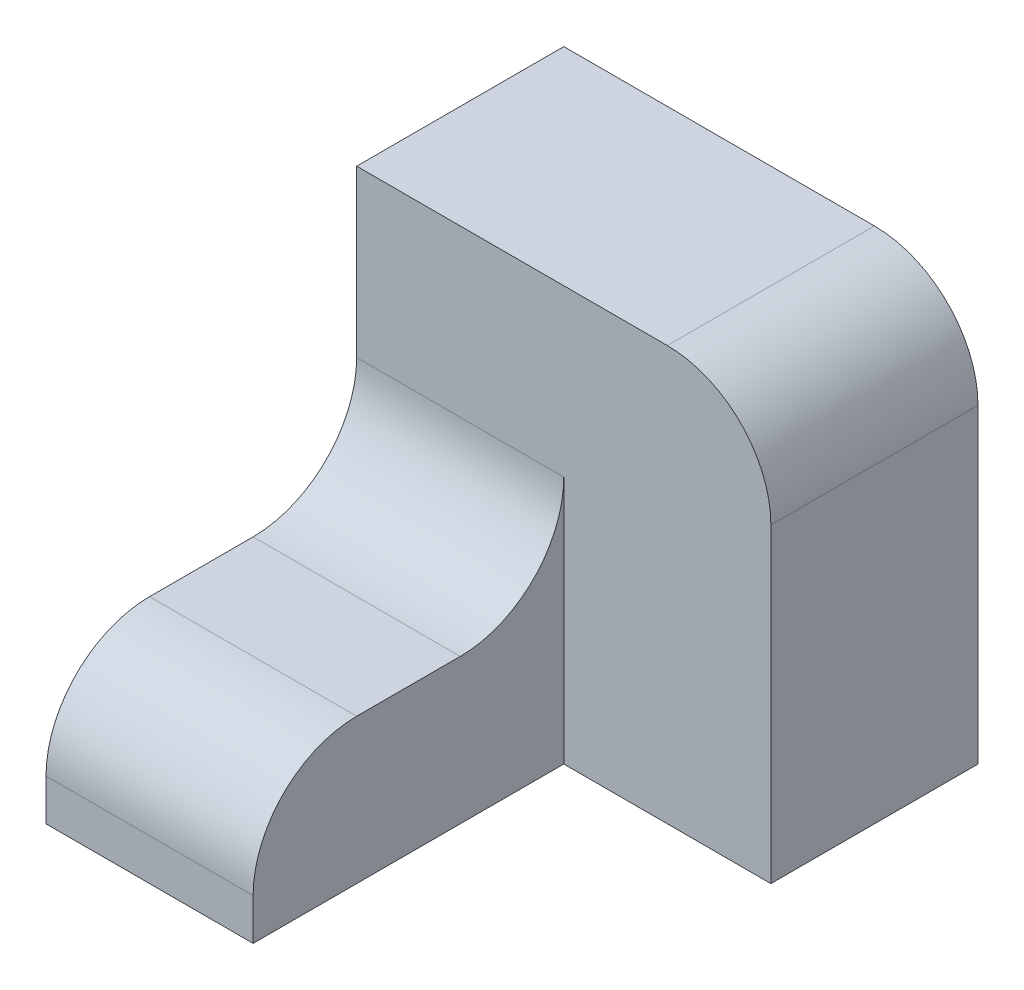
ISO-10303-21;
HEADER;
FILE_DESCRIPTION(('STEP AP214'),'2;1');
FILE_NAME('part.step','',(''),(''),'','','');
FILE_SCHEMA(('AUTOMOTIVE_DESIGN { 1 0 10303 214 1 1 1 1 }'));
ENDSEC;
DATA;
#1=APPLICATION_CONTEXT('core data for automotive mechanical design processes');
#2=APPLICATION_PROTOCOL_DEFINITION('international standard','automotive_design',2000,#1);
#3=PRODUCT_CONTEXT('',#1,'mechanical');
#4=PRODUCT('Part','Part','',(#3));
#5=PRODUCT_RELATED_PRODUCT_CATEGORY('part','',(#4));
#6=PRODUCT_DEFINITION_FORMATION('','',#4);
#7=PRODUCT_DEFINITION_CONTEXT('part definition',#1,'design');
#8=PRODUCT_DEFINITION('design','',#6,#7);
#9=PRODUCT_DEFINITION_SHAPE('','',#8);
#10=(LENGTH_UNIT() NAMED_UNIT(*) SI_UNIT(.MILLI.,.METRE.));
#11=(NAMED_UNIT(*) PLANE_ANGLE_UNIT() SI_UNIT($,.RADIAN.));
#12=(NAMED_UNIT(*) SI_UNIT($,.STERADIAN.) SOLID_ANGLE_UNIT());
#13=UNCERTAINTY_MEASURE_WITH_UNIT(LENGTH_MEASURE(1.E-05),#10,'distance_accuracy_value','');
#14=(GEOMETRIC_REPRESENTATION_CONTEXT(3) GLOBAL_UNCERTAINTY_ASSIGNED_CONTEXT((#13)) GLOBAL_UNIT_ASSIGNED_CONTEXT((#10,
#11,#12)) REPRESENTATION_CONTEXT('',''));
#15=CARTESIAN_POINT('',(0.,0.,0.));
#16=DIRECTION('',(0.,0.,1.));
#17=DIRECTION('',(1.,0.,0.));
#18=AXIS2_PLACEMENT_3D('',#15,#16,#17);
#19=CARTESIAN_POINT('',(-10.,0.,30.));
#20=DIRECTION('',(0.,-1.,0.));
#21=DIRECTION('',(1.,0.,0.));
#22=AXIS2_PLACEMENT_3D('',#19,#20,#21);
#23=PLANE('',#22);
#24=DIRECTION('',(0.,0.,-1.));
#25=VECTOR('',#24,1.);
#26=CARTESIAN_POINT('',(-10.,0.,30.));
#27=LINE('',#26,#25);
#28=CARTESIAN_POINT('',(-10.,0.,20.));
#29=VERTEX_POINT('',#28);
#30=CARTESIAN_POINT('',(-10.,0.,10.));
#31=VERTEX_POINT('',#30);
#32=EDGE_CURVE('E164',#29,#31,#27,.T.);
#33=ORIENTED_EDGE('',*,*,#32,.T.);
#34=DIRECTION('',(-1.,0.,0.));
#35=VECTOR('',#34,1.);
#36=CARTESIAN_POINT('',(-10.,0.,10.));
#37=LINE('',#36,#35);
#38=CARTESIAN_POINT('',(-30.,0.,10.));
#39=VERTEX_POINT('',#38);
#40=EDGE_CURVE('E178',#31,#39,#37,.T.);
#41=ORIENTED_EDGE('',*,*,#40,.T.);
#42=DIRECTION('',(0.,0.,-1.));
#43=VECTOR('',#42,1.);
#44=CARTESIAN_POINT('',(-30.,0.,30.));
#45=LINE('',#44,#43);
#46=CARTESIAN_POINT('',(-30.,0.,20.));
#47=VERTEX_POINT('',#46);
#48=EDGE_CURVE('E173',#47,#39,#45,.T.);
#49=ORIENTED_EDGE('',*,*,#48,.F.);
#50=DIRECTION('',(-1.,0.,0.));
#51=VECTOR('',#50,1.);
#52=CARTESIAN_POINT('',(-10.,0.,20.));
#53=LINE('',#52,#51);
#54=EDGE_CURVE('E176',#47,#29,#53,.F.);
#55=ORIENTED_EDGE('',*,*,#54,.T.);
#56=EDGE_LOOP('',(#33,#41,#49,#55));
#57=FACE_BOUND('',#56,.T.);
#58=ADVANCED_FACE('F35',(#57),#23,.F.);
#59=CARTESIAN_POINT('',(-30.,0.,30.));
#60=DIRECTION('',(1.,0.,0.));
#61=DIRECTION('',(0.,0.,-1.));
#62=AXIS2_PLACEMENT_3D('',#59,#60,#61);
#63=PLANE('',#62);
#64=DIRECTION('',(0.,-1.,0.));
#65=VECTOR('',#64,1.);
#66=CARTESIAN_POINT('',(-30.,0.,30.));
#67=LINE('',#66,#65);
#68=CARTESIAN_POINT('',(-30.,-10.,30.));
#69=VERTEX_POINT('',#68);
#70=CARTESIAN_POINT('',(-30.,-14.,30.));
#71=VERTEX_POINT('',#70);
#72=EDGE_CURVE('E158',#69,#71,#67,.T.);
#73=ORIENTED_EDGE('',*,*,#72,.F.);
#74=CARTESIAN_POINT('',(-30.,-10.,20.));
#75=DIRECTION('',(1.,0.,0.));
#76=DIRECTION('',(0.,0.,-1.));
#77=AXIS2_PLACEMENT_3D('',#74,#75,#76);
#78=CIRCLE('',#77,10.);
#79=EDGE_CURVE('E58',#69,#47,#78,.F.);
#80=ORIENTED_EDGE('',*,*,#79,.T.);
#81=ORIENTED_EDGE('',*,*,#48,.T.);
#82=CARTESIAN_POINT('',(-30.,10.,10.));
#83=DIRECTION('',(1.,0.,0.));
#84=DIRECTION('',(0.,0.,-1.));
#85=AXIS2_PLACEMENT_3D('',#82,#83,#84);
#86=CIRCLE('',#85,10.);
#87=CARTESIAN_POINT('',(-30.,10.,0.));
#88=VERTEX_POINT('',#87);
#89=EDGE_CURVE('E43',#39,#88,#86,.T.);
#90=ORIENTED_EDGE('',*,*,#89,.T.);
#91=DIRECTION('',(0.,-1.,0.));
#92=VECTOR('',#91,1.);
#93=CARTESIAN_POINT('',(-30.,26.,0.));
#94=LINE('',#93,#92);
#95=CARTESIAN_POINT('',(-30.,26.,0.));
#96=VERTEX_POINT('',#95);
#97=EDGE_CURVE('E134',#96,#88,#94,.T.);
#98=ORIENTED_EDGE('',*,*,#97,.F.);
#99=DIRECTION('',(0.,0.,1.));
#100=VECTOR('',#99,1.);
#101=CARTESIAN_POINT('',(-30.,26.,-20.));
#102=LINE('',#101,#100);
#103=CARTESIAN_POINT('',(-30.,26.,-20.));
#104=VERTEX_POINT('',#103);
#105=EDGE_CURVE('E118',#104,#96,#102,.T.);
#106=ORIENTED_EDGE('',*,*,#105,.F.);
#107=DIRECTION('',(0.,-1.,0.));
#108=VECTOR('',#107,1.);
#109=CARTESIAN_POINT('',(-30.,26.,-20.));
#110=LINE('',#109,#108);
#111=CARTESIAN_POINT('',(-30.,-14.,-20.));
#112=VERTEX_POINT('',#111);
#113=EDGE_CURVE('E125',#104,#112,#110,.T.);
#114=ORIENTED_EDGE('',*,*,#113,.T.);
#115=DIRECTION('',(0.,0.,-1.));
#116=VECTOR('',#115,1.);
#117=CARTESIAN_POINT('',(-30.,-14.,30.));
#118=LINE('',#117,#116);
#119=EDGE_CURVE('E171',#71,#112,#118,.T.);
#120=ORIENTED_EDGE('',*,*,#119,.F.);
#121=EDGE_LOOP('',(#73,#80,#81,#90,#98,#106,#114,#120));
#122=FACE_BOUND('',#121,.T.);
#123=ADVANCED_FACE('F131',(#122),#63,.F.);
#124=CARTESIAN_POINT('',(-30.,-14.,30.));
#125=DIRECTION('',(0.,1.,0.));
#126=DIRECTION('',(0.,0.,1.));
#127=AXIS2_PLACEMENT_3D('',#124,#125,#126);
#128=PLANE('',#127);
#129=ORIENTED_EDGE('',*,*,#119,.T.);
#130=DIRECTION('',(1.,0.,0.));
#131=VECTOR('',#130,1.);
#132=CARTESIAN_POINT('',(-30.,-14.,-20.));
#133=LINE('',#132,#131);
#134=CARTESIAN_POINT('',(10.,-14.,-20.));
#135=VERTEX_POINT('',#134);
#136=EDGE_CURVE('E142',#112,#135,#133,.T.);
#137=ORIENTED_EDGE('',*,*,#136,.T.);
#138=DIRECTION('',(0.,0.,1.));
#139=VECTOR('',#138,1.);
#140=CARTESIAN_POINT('',(10.,-14.,-20.));
#141=LINE('',#140,#139);
#142=CARTESIAN_POINT('',(10.,-14.,0.));
#143=VERTEX_POINT('',#142);
#144=EDGE_CURVE('E135',#135,#143,#141,.T.);
#145=ORIENTED_EDGE('',*,*,#144,.T.);
#146=DIRECTION('',(1.,0.,0.));
#147=VECTOR('',#146,1.);
#148=CARTESIAN_POINT('',(-30.,-14.,0.));
#149=LINE('',#148,#147);
#150=CARTESIAN_POINT('',(-10.,-14.,0.));
#151=VERTEX_POINT('',#150);
#152=EDGE_CURVE('E151',#151,#143,#149,.T.);
#153=ORIENTED_EDGE('',*,*,#152,.F.);
#154=DIRECTION('',(0.,0.,-1.));
#155=VECTOR('',#154,1.);
#156=CARTESIAN_POINT('',(-10.,-14.,30.));
#157=LINE('',#156,#155);
#158=CARTESIAN_POINT('',(-10.,-14.,30.));
#159=VERTEX_POINT('',#158);
#160=EDGE_CURVE('E168',#159,#151,#157,.T.);
#161=ORIENTED_EDGE('',*,*,#160,.F.);
#162=DIRECTION('',(1.,0.,0.));
#163=VECTOR('',#162,1.);
#164=CARTESIAN_POINT('',(-30.,-14.,30.));
#165=LINE('',#164,#163);
#166=EDGE_CURVE('E160',#71,#159,#165,.T.);
#167=ORIENTED_EDGE('',*,*,#166,.F.);
#168=EDGE_LOOP('',(#129,#137,#145,#153,#161,#167));
#169=FACE_BOUND('',#168,.T.);
#170=ADVANCED_FACE('F210',(#169),#128,.F.);
#171=CARTESIAN_POINT('',(-10.,-14.,30.));
#172=DIRECTION('',(-1.,0.,0.));
#173=DIRECTION('',(0.,0.,1.));
#174=AXIS2_PLACEMENT_3D('',#171,#172,#173);
#175=PLANE('',#174);
#176=ORIENTED_EDGE('',*,*,#32,.F.);
#177=CARTESIAN_POINT('',(-10.,-10.,20.));
#178=DIRECTION('',(-1.,0.,0.));
#179=DIRECTION('',(0.,0.,1.));
#180=AXIS2_PLACEMENT_3D('',#177,#178,#179);
#181=CIRCLE('',#180,10.);
#182=CARTESIAN_POINT('',(-10.,-10.,30.));
#183=VERTEX_POINT('',#182);
#184=EDGE_CURVE('E50',#29,#183,#181,.F.);
#185=ORIENTED_EDGE('',*,*,#184,.T.);
#186=DIRECTION('',(0.,1.,0.));
#187=VECTOR('',#186,1.);
#188=CARTESIAN_POINT('',(-10.,-14.,30.));
#189=LINE('',#188,#187);
#190=EDGE_CURVE('E162',#159,#183,#189,.T.);
#191=ORIENTED_EDGE('',*,*,#190,.F.);
#192=ORIENTED_EDGE('',*,*,#160,.T.);
#193=DIRECTION('',(0.,1.,0.));
#194=VECTOR('',#193,1.);
#195=CARTESIAN_POINT('',(-10.,-14.,0.));
#196=LINE('',#195,#194);
#197=CARTESIAN_POINT('',(-10.,10.,0.));
#198=VERTEX_POINT('',#197);
#199=EDGE_CURVE('E156',#151,#198,#196,.T.);
#200=ORIENTED_EDGE('',*,*,#199,.T.);
#201=CARTESIAN_POINT('',(-10.,10.,10.));
#202=DIRECTION('',(-1.,0.,0.));
#203=DIRECTION('',(0.,0.,1.));
#204=AXIS2_PLACEMENT_3D('',#201,#202,#203);
#205=CIRCLE('',#204,10.);
#206=EDGE_CURVE('E11',#198,#31,#205,.T.);
#207=ORIENTED_EDGE('',*,*,#206,.T.);
#208=EDGE_LOOP('',(#176,#185,#191,#192,#200,#207));
#209=FACE_BOUND('',#208,.T.);
#210=ADVANCED_FACE('F203',(#209),#175,.F.);
#211=CARTESIAN_POINT('',(0.,0.,30.));
#212=DIRECTION('',(0.,0.,1.));
#213=DIRECTION('',(1.,0.,0.));
#214=AXIS2_PLACEMENT_3D('',#211,#212,#213);
#215=PLANE('',#214);
#216=ORIENTED_EDGE('',*,*,#190,.T.);
#217=DIRECTION('',(-1.,0.,0.));
#218=VECTOR('',#217,1.);
#219=CARTESIAN_POINT('',(-30.,-10.,30.));
#220=LINE('',#219,#218);
#221=EDGE_CURVE('E192',#183,#69,#220,.T.);
#222=ORIENTED_EDGE('',*,*,#221,.T.);
#223=ORIENTED_EDGE('',*,*,#72,.T.);
#224=ORIENTED_EDGE('',*,*,#166,.T.);
#225=EDGE_LOOP('',(#216,#222,#223,#224));
#226=FACE_BOUND('',#225,.T.);
#227=ADVANCED_FACE('F206',(#226),#215,.T.);
#228=CARTESIAN_POINT('',(0.,0.,0.));
#229=DIRECTION('',(0.,0.,1.));
#230=DIRECTION('',(1.,0.,0.));
#231=AXIS2_PLACEMENT_3D('',#228,#229,#230);
#232=PLANE('',#231);
#233=ORIENTED_EDGE('',*,*,#97,.T.);
#234=DIRECTION('',(-1.,0.,0.));
#235=VECTOR('',#234,1.);
#236=CARTESIAN_POINT('',(0.,10.,0.));
#237=LINE('',#236,#235);
#238=EDGE_CURVE('E183',#88,#198,#237,.F.);
#239=ORIENTED_EDGE('',*,*,#238,.T.);
#240=ORIENTED_EDGE('',*,*,#199,.F.);
#241=ORIENTED_EDGE('',*,*,#152,.T.);
#242=DIRECTION('',(0.,1.,0.));
#243=VECTOR('',#242,1.);
#244=CARTESIAN_POINT('',(10.,-14.,0.));
#245=LINE('',#244,#243);
#246=CARTESIAN_POINT('',(10.,16.,0.));
#247=VERTEX_POINT('',#246);
#248=EDGE_CURVE('E126',#143,#247,#245,.T.);
#249=ORIENTED_EDGE('',*,*,#248,.T.);
#250=CARTESIAN_POINT('',(0.,16.,0.));
#251=DIRECTION('',(0.,0.,1.));
#252=DIRECTION('',(1.,0.,0.));
#253=AXIS2_PLACEMENT_3D('',#250,#251,#252);
#254=CIRCLE('',#253,10.);
#255=CARTESIAN_POINT('',(0.,26.,0.));
#256=VERTEX_POINT('',#255);
#257=EDGE_CURVE('E181',#247,#256,#254,.T.);
#258=ORIENTED_EDGE('',*,*,#257,.T.);
#259=DIRECTION('',(-1.,0.,0.));
#260=VECTOR('',#259,1.);
#261=CARTESIAN_POINT('',(10.,26.,0.));
#262=LINE('',#261,#260);
#263=EDGE_CURVE('E148',#256,#96,#262,.T.);
#264=ORIENTED_EDGE('',*,*,#263,.T.);
#265=EDGE_LOOP('',(#233,#239,#240,#241,#249,#258,#264));
#266=FACE_BOUND('',#265,.T.);
#267=ADVANCED_FACE('F200',(#266),#232,.T.);
#268=CARTESIAN_POINT('',(10.,26.,-20.));
#269=DIRECTION('',(0.,1.,0.));
#270=DIRECTION('',(0.,0.,1.));
#271=AXIS2_PLACEMENT_3D('',#268,#269,#270);
#272=PLANE('',#271);
#273=ORIENTED_EDGE('',*,*,#263,.F.);
#274=DIRECTION('',(0.,0.,1.));
#275=VECTOR('',#274,1.);
#276=CARTESIAN_POINT('',(0.,26.,-20.));
#277=LINE('',#276,#275);
#278=CARTESIAN_POINT('',(0.,26.,-20.));
#279=VERTEX_POINT('',#278);
#280=EDGE_CURVE('E121',#256,#279,#277,.F.);
#281=ORIENTED_EDGE('',*,*,#280,.T.);
#282=DIRECTION('',(-1.,0.,0.));
#283=VECTOR('',#282,1.);
#284=CARTESIAN_POINT('',(10.,26.,-20.));
#285=LINE('',#284,#283);
#286=EDGE_CURVE('E114',#279,#104,#285,.T.);
#287=ORIENTED_EDGE('',*,*,#286,.T.);
#288=ORIENTED_EDGE('',*,*,#105,.T.);
#289=EDGE_LOOP('',(#273,#281,#287,#288));
#290=FACE_BOUND('',#289,.T.);
#291=ADVANCED_FACE('F117',(#290),#272,.T.);
#292=CARTESIAN_POINT('',(10.,-14.,-20.));
#293=DIRECTION('',(1.,0.,0.));
#294=DIRECTION('',(0.,0.,-1.));
#295=AXIS2_PLACEMENT_3D('',#292,#293,#294);
#296=PLANE('',#295);
#297=DIRECTION('',(0.,1.,0.));
#298=VECTOR('',#297,1.);
#299=CARTESIAN_POINT('',(10.,-14.,-20.));
#300=LINE('',#299,#298);
#301=CARTESIAN_POINT('',(10.,16.,-20.));
#302=VERTEX_POINT('',#301);
#303=EDGE_CURVE('E136',#135,#302,#300,.T.);
#304=ORIENTED_EDGE('',*,*,#303,.T.);
#305=DIRECTION('',(0.,0.,1.));
#306=VECTOR('',#305,1.);
#307=CARTESIAN_POINT('',(10.,16.,-20.));
#308=LINE('',#307,#306);
#309=EDGE_CURVE('E186',#302,#247,#308,.T.);
#310=ORIENTED_EDGE('',*,*,#309,.T.);
#311=ORIENTED_EDGE('',*,*,#248,.F.);
#312=ORIENTED_EDGE('',*,*,#144,.F.);
#313=EDGE_LOOP('',(#304,#310,#311,#312));
#314=FACE_BOUND('',#313,.T.);
#315=ADVANCED_FACE('F214',(#314),#296,.T.);
#316=CARTESIAN_POINT('',(0.,0.,-20.));
#317=DIRECTION('',(0.,0.,1.));
#318=DIRECTION('',(1.,0.,0.));
#319=AXIS2_PLACEMENT_3D('',#316,#317,#318);
#320=PLANE('',#319);
#321=ORIENTED_EDGE('',*,*,#286,.F.);
#322=CARTESIAN_POINT('',(0.,16.,-20.));
#323=DIRECTION('',(0.,0.,1.));
#324=DIRECTION('',(1.,0.,0.));
#325=AXIS2_PLACEMENT_3D('',#322,#323,#324);
#326=CIRCLE('',#325,10.);
#327=EDGE_CURVE('E190',#279,#302,#326,.F.);
#328=ORIENTED_EDGE('',*,*,#327,.T.);
#329=ORIENTED_EDGE('',*,*,#303,.F.);
#330=ORIENTED_EDGE('',*,*,#136,.F.);
#331=ORIENTED_EDGE('',*,*,#113,.F.);
#332=EDGE_LOOP('',(#321,#328,#329,#330,#331));
#333=FACE_BOUND('',#332,.T.);
#334=ADVANCED_FACE('F139',(#333),#320,.F.);
#335=CARTESIAN_POINT('',(-10.,10.,10.));
#336=DIRECTION('',(-1.,0.,0.));
#337=DIRECTION('',(0.,-1.,0.));
#338=AXIS2_PLACEMENT_3D('',#335,#336,#337);
#339=CYLINDRICAL_SURFACE('',#338,10.);
#340=ORIENTED_EDGE('',*,*,#206,.F.);
#341=ORIENTED_EDGE('',*,*,#238,.F.);
#342=ORIENTED_EDGE('',*,*,#89,.F.);
#343=ORIENTED_EDGE('',*,*,#40,.F.);
#344=EDGE_LOOP('',(#340,#341,#342,#343));
#345=FACE_BOUND('',#344,.T.);
#346=ADVANCED_FACE('F202',(#345),#339,.F.);
#347=CARTESIAN_POINT('',(0.,16.,-20.));
#348=DIRECTION('',(0.,0.,1.));
#349=DIRECTION('',(1.,0.,0.));
#350=AXIS2_PLACEMENT_3D('',#347,#348,#349);
#351=CYLINDRICAL_SURFACE('',#350,10.);
#352=ORIENTED_EDGE('',*,*,#327,.F.);
#353=ORIENTED_EDGE('',*,*,#280,.F.);
#354=ORIENTED_EDGE('',*,*,#257,.F.);
#355=ORIENTED_EDGE('',*,*,#309,.F.);
#356=EDGE_LOOP('',(#352,#353,#354,#355));
#357=FACE_BOUND('',#356,.T.);
#358=ADVANCED_FACE('F217',(#357),#351,.T.);
#359=CARTESIAN_POINT('',(0.,-10.,20.));
#360=DIRECTION('',(1.,0.,0.));
#361=DIRECTION('',(0.,1.,0.));
#362=AXIS2_PLACEMENT_3D('',#359,#360,#361);
#363=CYLINDRICAL_SURFACE('',#362,10.);
#364=ORIENTED_EDGE('',*,*,#184,.F.);
#365=ORIENTED_EDGE('',*,*,#54,.F.);
#366=ORIENTED_EDGE('',*,*,#79,.F.);
#367=ORIENTED_EDGE('',*,*,#221,.F.);
#368=EDGE_LOOP('',(#364,#365,#366,#367));
#369=FACE_BOUND('',#368,.T.);
#370=ADVANCED_FACE('F37',(#369),#363,.T.);
#371=CLOSED_SHELL('',(#58,#123,#170,#210,#227,#267,#291,#315,#334,#346,#358,#370));
#372=MANIFOLD_SOLID_BREP('B2',#371);
#373=ADVANCED_BREP_SHAPE_REPRESENTATION('',(#18,#372),#14);
#374=SHAPE_DEFINITION_REPRESENTATION(#9,#373);
ENDSEC;
END-ISO-10303-21;
